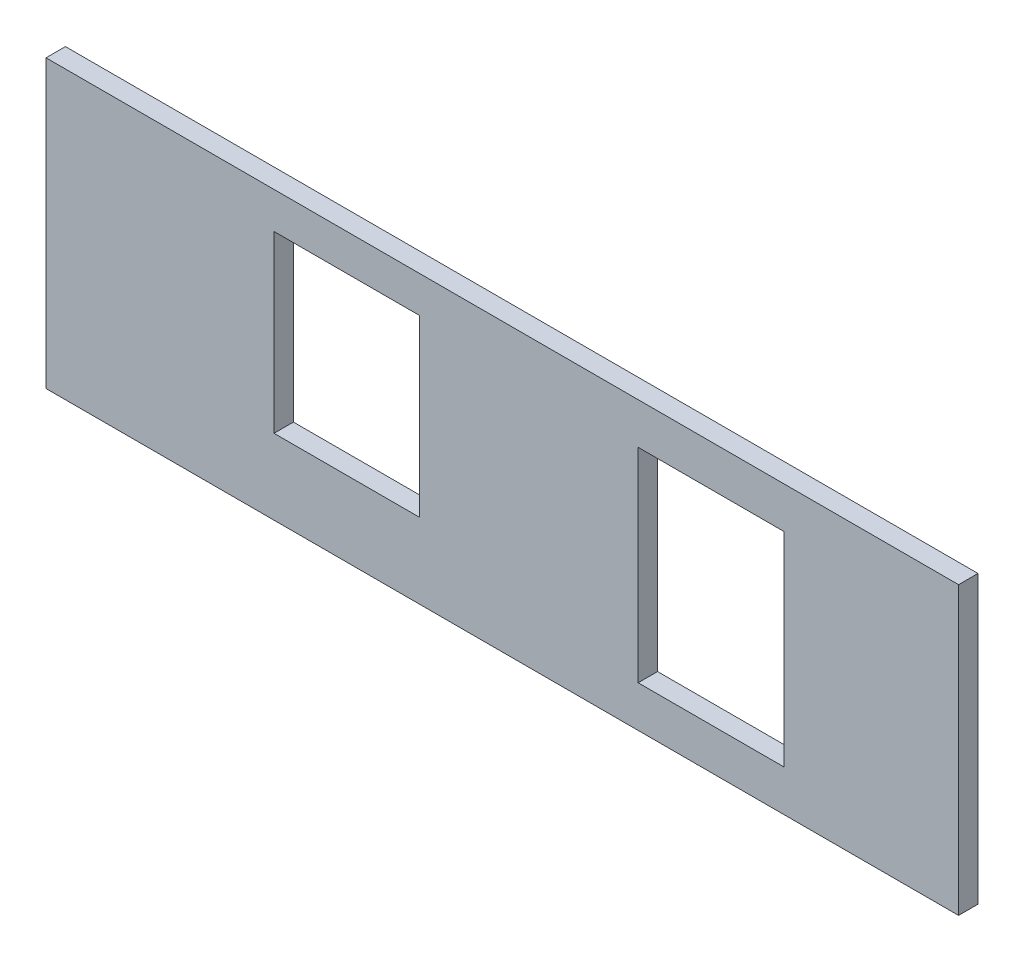
ISO-10303-21;
HEADER;
FILE_DESCRIPTION(('STEP AP214'),'2;1');
FILE_NAME('part.step','',(''),(''),'','','');
FILE_SCHEMA(('AUTOMOTIVE_DESIGN { 1 0 10303 214 1 1 1 1 }'));
ENDSEC;
DATA;
#1=APPLICATION_CONTEXT('core data for automotive mechanical design processes');
#2=APPLICATION_PROTOCOL_DEFINITION('international standard','automotive_design',2000,#1);
#3=PRODUCT_CONTEXT('',#1,'mechanical');
#4=PRODUCT('Part','Part','',(#3));
#5=PRODUCT_RELATED_PRODUCT_CATEGORY('part','',(#4));
#6=PRODUCT_DEFINITION_FORMATION('','',#4);
#7=PRODUCT_DEFINITION_CONTEXT('part definition',#1,'design');
#8=PRODUCT_DEFINITION('design','',#6,#7);
#9=PRODUCT_DEFINITION_SHAPE('','',#8);
#10=(LENGTH_UNIT() NAMED_UNIT(*) SI_UNIT(.MILLI.,.METRE.));
#11=(NAMED_UNIT(*) PLANE_ANGLE_UNIT() SI_UNIT($,.RADIAN.));
#12=(NAMED_UNIT(*) SI_UNIT($,.STERADIAN.) SOLID_ANGLE_UNIT());
#13=UNCERTAINTY_MEASURE_WITH_UNIT(LENGTH_MEASURE(1.E-05),#10,'distance_accuracy_value','');
#14=(GEOMETRIC_REPRESENTATION_CONTEXT(3) GLOBAL_UNCERTAINTY_ASSIGNED_CONTEXT((#13)) GLOBAL_UNIT_ASSIGNED_CONTEXT((#10,
#11,#12)) REPRESENTATION_CONTEXT('',''));
#15=CARTESIAN_POINT('',(0.,0.,0.));
#16=DIRECTION('',(0.,0.,1.));
#17=DIRECTION('',(1.,0.,0.));
#18=AXIS2_PLACEMENT_3D('',#15,#16,#17);
#19=CARTESIAN_POINT('',(0.,0.,20.));
#20=DIRECTION('',(0.,0.,-1.));
#21=DIRECTION('',(-1.,0.,0.));
#22=AXIS2_PLACEMENT_3D('',#19,#20,#21);
#23=PLANE('',#22);
#24=DIRECTION('',(1.,0.,0.));
#25=VECTOR('',#24,1.);
#26=CARTESIAN_POINT('',(0.,430.000000000001,20.));
#27=LINE('',#26,#25);
#28=CARTESIAN_POINT('',(100.,430.000000000001,20.));
#29=VERTEX_POINT('',#28);
#30=CARTESIAN_POINT('',(250.,430.000000000001,20.));
#31=VERTEX_POINT('',#30);
#32=EDGE_CURVE('E178',#29,#31,#27,.T.);
#33=ORIENTED_EDGE('',*,*,#32,.T.);
#34=DIRECTION('',(0.,-1.,0.));
#35=VECTOR('',#34,1.);
#36=CARTESIAN_POINT('',(250.,0.,20.));
#37=LINE('',#36,#35);
#38=CARTESIAN_POINT('',(250.,220.000000000001,20.));
#39=VERTEX_POINT('',#38);
#40=EDGE_CURVE('E165',#31,#39,#37,.T.);
#41=ORIENTED_EDGE('',*,*,#40,.T.);
#42=DIRECTION('',(-1.,0.,0.));
#43=VECTOR('',#42,1.);
#44=CARTESIAN_POINT('',(0.,220.000000000001,20.));
#45=LINE('',#44,#43);
#46=CARTESIAN_POINT('',(100.,220.000000000001,20.));
#47=VERTEX_POINT('',#46);
#48=EDGE_CURVE('E184',#39,#47,#45,.T.);
#49=ORIENTED_EDGE('',*,*,#48,.T.);
#50=DIRECTION('',(0.,1.,0.));
#51=VECTOR('',#50,1.);
#52=CARTESIAN_POINT('',(100.,0.,20.));
#53=LINE('',#52,#51);
#54=EDGE_CURVE('E181',#47,#29,#53,.T.);
#55=ORIENTED_EDGE('',*,*,#54,.T.);
#56=EDGE_LOOP('',(#33,#41,#49,#55));
#57=FACE_BOUND('',#56,.T.);
#58=DIRECTION('',(1.,0.,0.));
#59=VECTOR('',#58,1.);
#60=CARTESIAN_POINT('',(-275.,255.,20.));
#61=LINE('',#60,#59);
#62=CARTESIAN_POINT('',(-275.,255.,20.));
#63=VERTEX_POINT('',#62);
#64=CARTESIAN_POINT('',(-125.,255.,20.));
#65=VERTEX_POINT('',#64);
#66=EDGE_CURVE('E160',#63,#65,#61,.T.);
#67=ORIENTED_EDGE('',*,*,#66,.F.);
#68=DIRECTION('',(0.,-1.,0.));
#69=VECTOR('',#68,1.);
#70=CARTESIAN_POINT('',(-275.,435.,20.));
#71=LINE('',#70,#69);
#72=CARTESIAN_POINT('',(-275.,435.,20.));
#73=VERTEX_POINT('',#72);
#74=EDGE_CURVE('E163',#73,#63,#71,.T.);
#75=ORIENTED_EDGE('',*,*,#74,.F.);
#76=DIRECTION('',(-1.,0.,0.));
#77=VECTOR('',#76,1.);
#78=CARTESIAN_POINT('',(-275.,435.,20.));
#79=LINE('',#78,#77);
#80=CARTESIAN_POINT('',(-125.,435.,20.));
#81=VERTEX_POINT('',#80);
#82=EDGE_CURVE('E153',#81,#73,#79,.T.);
#83=ORIENTED_EDGE('',*,*,#82,.F.);
#84=DIRECTION('',(0.,1.,0.));
#85=VECTOR('',#84,1.);
#86=CARTESIAN_POINT('',(-125.,435.,20.));
#87=LINE('',#86,#85);
#88=EDGE_CURVE('E157',#65,#81,#87,.T.);
#89=ORIENTED_EDGE('',*,*,#88,.F.);
#90=EDGE_LOOP('',(#67,#75,#83,#89));
#91=FACE_BOUND('',#90,.T.);
#92=DIRECTION('',(-1.,0.,0.));
#93=VECTOR('',#92,1.);
#94=CARTESIAN_POINT('',(0.,472.5,20.));
#95=LINE('',#94,#93);
#96=CARTESIAN_POINT('',(430.,472.5,20.));
#97=VERTEX_POINT('',#96);
#98=CARTESIAN_POINT('',(-509.8,472.5,20.));
#99=VERTEX_POINT('',#98);
#100=EDGE_CURVE('E207',#97,#99,#95,.T.);
#101=ORIENTED_EDGE('',*,*,#100,.T.);
#102=DIRECTION('',(0.,-1.,0.));
#103=VECTOR('',#102,1.);
#104=CARTESIAN_POINT('',(-509.8,0.,20.));
#105=LINE('',#104,#103);
#106=CARTESIAN_POINT('',(-509.8,177.5,20.));
#107=VERTEX_POINT('',#106);
#108=EDGE_CURVE('E123',#99,#107,#105,.T.);
#109=ORIENTED_EDGE('',*,*,#108,.T.);
#110=DIRECTION('',(1.,0.,0.));
#111=VECTOR('',#110,1.);
#112=CARTESIAN_POINT('',(0.,177.500000000001,20.));
#113=LINE('',#112,#111);
#114=CARTESIAN_POINT('',(430.,177.500000000001,20.));
#115=VERTEX_POINT('',#114);
#116=EDGE_CURVE('E209',#107,#115,#113,.T.);
#117=ORIENTED_EDGE('',*,*,#116,.T.);
#118=DIRECTION('',(0.,1.,0.));
#119=VECTOR('',#118,1.);
#120=CARTESIAN_POINT('',(430.,0.,20.));
#121=LINE('',#120,#119);
#122=EDGE_CURVE('E49',#115,#97,#121,.T.);
#123=ORIENTED_EDGE('',*,*,#122,.T.);
#124=EDGE_LOOP('',(#101,#109,#117,#123));
#125=FACE_BOUND('',#124,.T.);
#126=ADVANCED_FACE('F34',(#57,#91,#125),#23,.F.);
#127=CARTESIAN_POINT('',(0.,0.,0.));
#128=DIRECTION('',(0.,0.,-1.));
#129=DIRECTION('',(-1.,0.,0.));
#130=AXIS2_PLACEMENT_3D('',#127,#128,#129);
#131=PLANE('',#130);
#132=DIRECTION('',(0.,-1.,0.));
#133=VECTOR('',#132,1.);
#134=CARTESIAN_POINT('',(-509.8,177.5,0.));
#135=LINE('',#134,#133);
#136=CARTESIAN_POINT('',(-509.8,472.5,0.));
#137=VERTEX_POINT('',#136);
#138=CARTESIAN_POINT('',(-509.8,177.500000000001,0.));
#139=VERTEX_POINT('',#138);
#140=EDGE_CURVE('E57',#137,#139,#135,.T.);
#141=ORIENTED_EDGE('',*,*,#140,.F.);
#142=DIRECTION('',(-1.,0.,0.));
#143=VECTOR('',#142,1.);
#144=CARTESIAN_POINT('',(0.,472.5,0.));
#145=LINE('',#144,#143);
#146=CARTESIAN_POINT('',(430.,472.5,0.));
#147=VERTEX_POINT('',#146);
#148=EDGE_CURVE('E134',#147,#137,#145,.T.);
#149=ORIENTED_EDGE('',*,*,#148,.F.);
#150=DIRECTION('',(0.,1.,0.));
#151=VECTOR('',#150,1.);
#152=CARTESIAN_POINT('',(430.,177.500000000001,0.));
#153=LINE('',#152,#151);
#154=CARTESIAN_POINT('',(430.,177.500000000001,0.));
#155=VERTEX_POINT('',#154);
#156=EDGE_CURVE('E216',#155,#147,#153,.T.);
#157=ORIENTED_EDGE('',*,*,#156,.F.);
#158=DIRECTION('',(1.,0.,0.));
#159=VECTOR('',#158,1.);
#160=CARTESIAN_POINT('',(-773.048091570672,177.500000000001,0.));
#161=LINE('',#160,#159);
#162=EDGE_CURVE('E136',#139,#155,#161,.T.);
#163=ORIENTED_EDGE('',*,*,#162,.F.);
#164=EDGE_LOOP('',(#141,#149,#157,#163));
#165=FACE_BOUND('',#164,.T.);
#166=DIRECTION('',(0.,-1.,0.));
#167=VECTOR('',#166,1.);
#168=CARTESIAN_POINT('',(250.,220.000000000001,0.));
#169=LINE('',#168,#167);
#170=CARTESIAN_POINT('',(250.,430.000000000001,0.));
#171=VERTEX_POINT('',#170);
#172=CARTESIAN_POINT('',(250.,220.000000000001,0.));
#173=VERTEX_POINT('',#172);
#174=EDGE_CURVE('E205',#171,#173,#169,.T.);
#175=ORIENTED_EDGE('',*,*,#174,.F.);
#176=DIRECTION('',(1.,0.,0.));
#177=VECTOR('',#176,1.);
#178=CARTESIAN_POINT('',(250.,430.000000000001,0.));
#179=LINE('',#178,#177);
#180=CARTESIAN_POINT('',(100.,430.000000000001,0.));
#181=VERTEX_POINT('',#180);
#182=EDGE_CURVE('E192',#181,#171,#179,.T.);
#183=ORIENTED_EDGE('',*,*,#182,.F.);
#184=DIRECTION('',(0.,1.,0.));
#185=VECTOR('',#184,1.);
#186=CARTESIAN_POINT('',(100.,220.000000000001,0.));
#187=LINE('',#186,#185);
#188=CARTESIAN_POINT('',(100.,220.000000000001,0.));
#189=VERTEX_POINT('',#188);
#190=EDGE_CURVE('E199',#189,#181,#187,.T.);
#191=ORIENTED_EDGE('',*,*,#190,.F.);
#192=DIRECTION('',(-1.,0.,0.));
#193=VECTOR('',#192,1.);
#194=CARTESIAN_POINT('',(250.,220.000000000001,0.));
#195=LINE('',#194,#193);
#196=EDGE_CURVE('E202',#173,#189,#195,.T.);
#197=ORIENTED_EDGE('',*,*,#196,.F.);
#198=EDGE_LOOP('',(#175,#183,#191,#197));
#199=FACE_BOUND('',#198,.T.);
#200=DIRECTION('',(0.,-1.,0.));
#201=VECTOR('',#200,1.);
#202=CARTESIAN_POINT('',(-275.,435.,0.));
#203=LINE('',#202,#201);
#204=CARTESIAN_POINT('',(-275.,435.,0.));
#205=VERTEX_POINT('',#204);
#206=CARTESIAN_POINT('',(-275.,255.,0.));
#207=VERTEX_POINT('',#206);
#208=EDGE_CURVE('E156',#205,#207,#203,.T.);
#209=ORIENTED_EDGE('',*,*,#208,.T.);
#210=DIRECTION('',(1.,0.,0.));
#211=VECTOR('',#210,1.);
#212=CARTESIAN_POINT('',(-275.,255.,0.));
#213=LINE('',#212,#211);
#214=CARTESIAN_POINT('',(-125.,255.,0.));
#215=VERTEX_POINT('',#214);
#216=EDGE_CURVE('E171',#207,#215,#213,.T.);
#217=ORIENTED_EDGE('',*,*,#216,.T.);
#218=DIRECTION('',(0.,1.,0.));
#219=VECTOR('',#218,1.);
#220=CARTESIAN_POINT('',(-125.,435.,0.));
#221=LINE('',#220,#219);
#222=CARTESIAN_POINT('',(-125.,435.,0.));
#223=VERTEX_POINT('',#222);
#224=EDGE_CURVE('E168',#215,#223,#221,.T.);
#225=ORIENTED_EDGE('',*,*,#224,.T.);
#226=DIRECTION('',(-1.,0.,0.));
#227=VECTOR('',#226,1.);
#228=CARTESIAN_POINT('',(-275.,435.,0.));
#229=LINE('',#228,#227);
#230=EDGE_CURVE('E150',#223,#205,#229,.T.);
#231=ORIENTED_EDGE('',*,*,#230,.T.);
#232=EDGE_LOOP('',(#209,#217,#225,#231));
#233=FACE_BOUND('',#232,.T.);
#234=ADVANCED_FACE('F36',(#165,#199,#233),#131,.T.);
#235=CARTESIAN_POINT('',(-275.,435.,0.));
#236=DIRECTION('',(-1.,0.,0.));
#237=DIRECTION('',(0.,0.,1.));
#238=AXIS2_PLACEMENT_3D('',#235,#236,#237);
#239=PLANE('',#238);
#240=ORIENTED_EDGE('',*,*,#74,.T.);
#241=DIRECTION('',(0.,0.,1.));
#242=VECTOR('',#241,1.);
#243=CARTESIAN_POINT('',(-275.,255.,0.));
#244=LINE('',#243,#242);
#245=EDGE_CURVE('E146',#207,#63,#244,.T.);
#246=ORIENTED_EDGE('',*,*,#245,.F.);
#247=ORIENTED_EDGE('',*,*,#208,.F.);
#248=DIRECTION('',(0.,0.,1.));
#249=VECTOR('',#248,1.);
#250=CARTESIAN_POINT('',(-275.,435.,0.));
#251=LINE('',#250,#249);
#252=EDGE_CURVE('E141',#205,#73,#251,.T.);
#253=ORIENTED_EDGE('',*,*,#252,.T.);
#254=EDGE_LOOP('',(#240,#246,#247,#253));
#255=FACE_BOUND('',#254,.T.);
#256=ADVANCED_FACE('F227',(#255),#239,.F.);
#257=CARTESIAN_POINT('',(-275.,435.,0.));
#258=DIRECTION('',(0.,1.,0.));
#259=DIRECTION('',(0.,0.,1.));
#260=AXIS2_PLACEMENT_3D('',#257,#258,#259);
#261=PLANE('',#260);
#262=ORIENTED_EDGE('',*,*,#82,.T.);
#263=ORIENTED_EDGE('',*,*,#252,.F.);
#264=ORIENTED_EDGE('',*,*,#230,.F.);
#265=DIRECTION('',(0.,0.,1.));
#266=VECTOR('',#265,1.);
#267=CARTESIAN_POINT('',(-125.,435.,0.));
#268=LINE('',#267,#266);
#269=EDGE_CURVE('E143',#223,#81,#268,.T.);
#270=ORIENTED_EDGE('',*,*,#269,.T.);
#271=EDGE_LOOP('',(#262,#263,#264,#270));
#272=FACE_BOUND('',#271,.T.);
#273=ADVANCED_FACE('F232',(#272),#261,.F.);
#274=CARTESIAN_POINT('',(-125.,435.,0.));
#275=DIRECTION('',(1.,0.,0.));
#276=DIRECTION('',(0.,1.,0.));
#277=AXIS2_PLACEMENT_3D('',#274,#275,#276);
#278=PLANE('',#277);
#279=ORIENTED_EDGE('',*,*,#88,.T.);
#280=ORIENTED_EDGE('',*,*,#269,.F.);
#281=ORIENTED_EDGE('',*,*,#224,.F.);
#282=DIRECTION('',(0.,0.,1.));
#283=VECTOR('',#282,1.);
#284=CARTESIAN_POINT('',(-125.,255.,0.));
#285=LINE('',#284,#283);
#286=EDGE_CURVE('E149',#215,#65,#285,.T.);
#287=ORIENTED_EDGE('',*,*,#286,.T.);
#288=EDGE_LOOP('',(#279,#280,#281,#287));
#289=FACE_BOUND('',#288,.T.);
#290=ADVANCED_FACE('F238',(#289),#278,.F.);
#291=CARTESIAN_POINT('',(-275.,255.,0.));
#292=DIRECTION('',(0.,-1.,0.));
#293=DIRECTION('',(1.,0.,0.));
#294=AXIS2_PLACEMENT_3D('',#291,#292,#293);
#295=PLANE('',#294);
#296=ORIENTED_EDGE('',*,*,#66,.T.);
#297=ORIENTED_EDGE('',*,*,#286,.F.);
#298=ORIENTED_EDGE('',*,*,#216,.F.);
#299=ORIENTED_EDGE('',*,*,#245,.T.);
#300=EDGE_LOOP('',(#296,#297,#298,#299));
#301=FACE_BOUND('',#300,.T.);
#302=ADVANCED_FACE('F234',(#301),#295,.F.);
#303=CARTESIAN_POINT('',(250.,220.000000000001,50.));
#304=DIRECTION('',(1.,0.,0.));
#305=DIRECTION('',(0.,0.,-1.));
#306=AXIS2_PLACEMENT_3D('',#303,#304,#305);
#307=PLANE('',#306);
#308=DIRECTION('',(0.,0.,-1.));
#309=VECTOR('',#308,1.);
#310=CARTESIAN_POINT('',(250.,430.000000000001,50.));
#311=LINE('',#310,#309);
#312=EDGE_CURVE('E187',#31,#171,#311,.T.);
#313=ORIENTED_EDGE('',*,*,#312,.T.);
#314=ORIENTED_EDGE('',*,*,#174,.T.);
#315=DIRECTION('',(0.,0.,-1.));
#316=VECTOR('',#315,1.);
#317=CARTESIAN_POINT('',(250.,220.000000000001,50.));
#318=LINE('',#317,#316);
#319=EDGE_CURVE('E188',#39,#173,#318,.T.);
#320=ORIENTED_EDGE('',*,*,#319,.F.);
#321=ORIENTED_EDGE('',*,*,#40,.F.);
#322=EDGE_LOOP('',(#313,#314,#320,#321));
#323=FACE_BOUND('',#322,.T.);
#324=ADVANCED_FACE('F237',(#323),#307,.F.);
#325=CARTESIAN_POINT('',(250.,430.000000000001,50.));
#326=DIRECTION('',(0.,1.,0.));
#327=DIRECTION('',(0.,0.,1.));
#328=AXIS2_PLACEMENT_3D('',#325,#326,#327);
#329=PLANE('',#328);
#330=DIRECTION('',(0.,0.,-1.));
#331=VECTOR('',#330,1.);
#332=CARTESIAN_POINT('',(100.,430.000000000001,50.));
#333=LINE('',#332,#331);
#334=EDGE_CURVE('E194',#29,#181,#333,.T.);
#335=ORIENTED_EDGE('',*,*,#334,.T.);
#336=ORIENTED_EDGE('',*,*,#182,.T.);
#337=ORIENTED_EDGE('',*,*,#312,.F.);
#338=ORIENTED_EDGE('',*,*,#32,.F.);
#339=EDGE_LOOP('',(#335,#336,#337,#338));
#340=FACE_BOUND('',#339,.T.);
#341=ADVANCED_FACE('F248',(#340),#329,.F.);
#342=CARTESIAN_POINT('',(100.,220.000000000001,50.));
#343=DIRECTION('',(-1.,0.,0.));
#344=DIRECTION('',(0.,0.,1.));
#345=AXIS2_PLACEMENT_3D('',#342,#343,#344);
#346=PLANE('',#345);
#347=DIRECTION('',(0.,0.,-1.));
#348=VECTOR('',#347,1.);
#349=CARTESIAN_POINT('',(100.,220.000000000001,50.));
#350=LINE('',#349,#348);
#351=EDGE_CURVE('E191',#47,#189,#350,.T.);
#352=ORIENTED_EDGE('',*,*,#351,.T.);
#353=ORIENTED_EDGE('',*,*,#190,.T.);
#354=ORIENTED_EDGE('',*,*,#334,.F.);
#355=ORIENTED_EDGE('',*,*,#54,.F.);
#356=EDGE_LOOP('',(#352,#353,#354,#355));
#357=FACE_BOUND('',#356,.T.);
#358=ADVANCED_FACE('F253',(#357),#346,.F.);
#359=CARTESIAN_POINT('',(250.,220.000000000001,50.));
#360=DIRECTION('',(0.,-1.,0.));
#361=DIRECTION('',(0.,0.,-1.));
#362=AXIS2_PLACEMENT_3D('',#359,#360,#361);
#363=PLANE('',#362);
#364=ORIENTED_EDGE('',*,*,#319,.T.);
#365=ORIENTED_EDGE('',*,*,#196,.T.);
#366=ORIENTED_EDGE('',*,*,#351,.F.);
#367=ORIENTED_EDGE('',*,*,#48,.F.);
#368=EDGE_LOOP('',(#364,#365,#366,#367));
#369=FACE_BOUND('',#368,.T.);
#370=ADVANCED_FACE('F250',(#369),#363,.F.);
#371=CARTESIAN_POINT('',(-694.017867726899,472.5,30.));
#372=DIRECTION('',(0.,-1.,0.));
#373=DIRECTION('',(1.,0.,0.));
#374=AXIS2_PLACEMENT_3D('',#371,#372,#373);
#375=PLANE('',#374);
#376=ORIENTED_EDGE('',*,*,#148,.T.);
#377=DIRECTION('',(0.,0.,-1.));
#378=VECTOR('',#377,1.);
#379=CARTESIAN_POINT('',(-509.8,472.5,30.));
#380=LINE('',#379,#378);
#381=EDGE_CURVE('E120',#99,#137,#380,.T.);
#382=ORIENTED_EDGE('',*,*,#381,.F.);
#383=ORIENTED_EDGE('',*,*,#100,.F.);
#384=DIRECTION('',(0.,0.,-1.));
#385=VECTOR('',#384,1.);
#386=CARTESIAN_POINT('',(430.,472.5,30.));
#387=LINE('',#386,#385);
#388=EDGE_CURVE('E137',#97,#147,#387,.T.);
#389=ORIENTED_EDGE('',*,*,#388,.T.);
#390=EDGE_LOOP('',(#376,#382,#383,#389));
#391=FACE_BOUND('',#390,.T.);
#392=ADVANCED_FACE('F140',(#391),#375,.F.);
#393=CARTESIAN_POINT('',(-773.048091570672,177.500000000001,30.));
#394=DIRECTION('',(0.,1.,0.));
#395=DIRECTION('',(-1.,0.,0.));
#396=AXIS2_PLACEMENT_3D('',#393,#394,#395);
#397=PLANE('',#396);
#398=ORIENTED_EDGE('',*,*,#116,.F.);
#399=DIRECTION('',(0.,0.,-1.));
#400=VECTOR('',#399,1.);
#401=CARTESIAN_POINT('',(-509.8,177.500000000001,30.));
#402=LINE('',#401,#400);
#403=EDGE_CURVE('E11',#107,#139,#402,.T.);
#404=ORIENTED_EDGE('',*,*,#403,.T.);
#405=ORIENTED_EDGE('',*,*,#162,.T.);
#406=DIRECTION('',(0.,0.,1.));
#407=VECTOR('',#406,1.);
#408=CARTESIAN_POINT('',(430.,177.500000000001,30.));
#409=LINE('',#408,#407);
#410=EDGE_CURVE('E42',#155,#115,#409,.T.);
#411=ORIENTED_EDGE('',*,*,#410,.T.);
#412=EDGE_LOOP('',(#398,#404,#405,#411));
#413=FACE_BOUND('',#412,.T.);
#414=ADVANCED_FACE('F220',(#413),#397,.F.);
#415=CARTESIAN_POINT('',(430.,177.500000000001,30.));
#416=DIRECTION('',(-1.,0.,0.));
#417=DIRECTION('',(0.,0.,1.));
#418=AXIS2_PLACEMENT_3D('',#415,#416,#417);
#419=PLANE('',#418);
#420=ORIENTED_EDGE('',*,*,#410,.F.);
#421=ORIENTED_EDGE('',*,*,#156,.T.);
#422=ORIENTED_EDGE('',*,*,#388,.F.);
#423=ORIENTED_EDGE('',*,*,#122,.F.);
#424=EDGE_LOOP('',(#420,#421,#422,#423));
#425=FACE_BOUND('',#424,.T.);
#426=ADVANCED_FACE('F217',(#425),#419,.F.);
#427=CARTESIAN_POINT('',(-509.8,177.5,30.));
#428=DIRECTION('',(1.,0.,0.));
#429=DIRECTION('',(0.,0.,-1.));
#430=AXIS2_PLACEMENT_3D('',#427,#428,#429);
#431=PLANE('',#430);
#432=ORIENTED_EDGE('',*,*,#381,.T.);
#433=ORIENTED_EDGE('',*,*,#140,.T.);
#434=ORIENTED_EDGE('',*,*,#403,.F.);
#435=ORIENTED_EDGE('',*,*,#108,.F.);
#436=EDGE_LOOP('',(#432,#433,#434,#435));
#437=FACE_BOUND('',#436,.T.);
#438=ADVANCED_FACE('F121',(#437),#431,.F.);
#439=CLOSED_SHELL('',(#126,#234,#256,#273,#290,#302,#324,#341,#358,#370,#392,#414,#426,#438));
#440=MANIFOLD_SOLID_BREP('B2',#439);
#441=ADVANCED_BREP_SHAPE_REPRESENTATION('',(#18,#440),#14);
#442=SHAPE_DEFINITION_REPRESENTATION(#9,#441);
ENDSEC;
END-ISO-10303-21;
